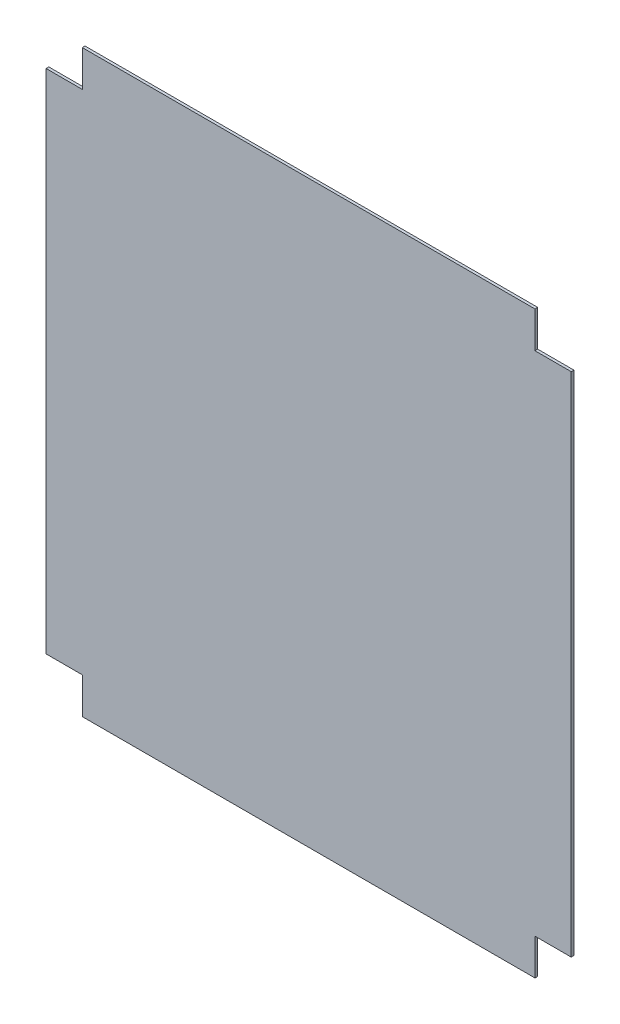
ISO-10303-21;
HEADER;
FILE_DESCRIPTION(('STEP AP214'),'2;1');
FILE_NAME('part.step','',(''),(''),'','','');
FILE_SCHEMA(('AUTOMOTIVE_DESIGN { 1 0 10303 214 1 1 1 1 }'));
ENDSEC;
DATA;
#1=APPLICATION_CONTEXT('core data for automotive mechanical design processes');
#2=APPLICATION_PROTOCOL_DEFINITION('international standard','automotive_design',2000,#1);
#3=PRODUCT_CONTEXT('',#1,'mechanical');
#4=PRODUCT('Part','Part','',(#3));
#5=PRODUCT_RELATED_PRODUCT_CATEGORY('part','',(#4));
#6=PRODUCT_DEFINITION_FORMATION('','',#4);
#7=PRODUCT_DEFINITION_CONTEXT('part definition',#1,'design');
#8=PRODUCT_DEFINITION('design','',#6,#7);
#9=PRODUCT_DEFINITION_SHAPE('','',#8);
#10=(LENGTH_UNIT() NAMED_UNIT(*) SI_UNIT(.MILLI.,.METRE.));
#11=(NAMED_UNIT(*) PLANE_ANGLE_UNIT() SI_UNIT($,.RADIAN.));
#12=(NAMED_UNIT(*) SI_UNIT($,.STERADIAN.) SOLID_ANGLE_UNIT());
#13=UNCERTAINTY_MEASURE_WITH_UNIT(LENGTH_MEASURE(1.E-05),#10,'distance_accuracy_value','');
#14=(GEOMETRIC_REPRESENTATION_CONTEXT(3) GLOBAL_UNCERTAINTY_ASSIGNED_CONTEXT((#13)) GLOBAL_UNIT_ASSIGNED_CONTEXT((#10,
#11,#12)) REPRESENTATION_CONTEXT('',''));
#15=CARTESIAN_POINT('',(0.,0.,0.));
#16=DIRECTION('',(0.,0.,1.));
#17=DIRECTION('',(1.,0.,0.));
#18=AXIS2_PLACEMENT_3D('',#15,#16,#17);
#19=CARTESIAN_POINT('',(-240.,390.,3.));
#20=DIRECTION('',(1.,0.,0.));
#21=DIRECTION('',(0.,0.,-1.));
#22=AXIS2_PLACEMENT_3D('',#19,#20,#21);
#23=PLANE('',#22);
#24=DIRECTION('',(0.,-1.,0.));
#25=VECTOR('',#24,1.);
#26=CARTESIAN_POINT('',(-240.,390.,0.));
#27=LINE('',#26,#25);
#28=CARTESIAN_POINT('',(-240.,390.,0.));
#29=VERTEX_POINT('',#28);
#30=CARTESIAN_POINT('',(-240.,350.,0.));
#31=VERTEX_POINT('',#30);
#32=EDGE_CURVE('E153',#29,#31,#27,.T.);
#33=ORIENTED_EDGE('',*,*,#32,.T.);
#34=DIRECTION('',(0.,0.,-1.));
#35=VECTOR('',#34,1.);
#36=CARTESIAN_POINT('',(-240.,350.,3.));
#37=LINE('',#36,#35);
#38=CARTESIAN_POINT('',(-240.,350.,3.));
#39=VERTEX_POINT('',#38);
#40=EDGE_CURVE('E11',#39,#31,#37,.T.);
#41=ORIENTED_EDGE('',*,*,#40,.F.);
#42=DIRECTION('',(0.,-1.,0.));
#43=VECTOR('',#42,1.);
#44=CARTESIAN_POINT('',(-240.,390.,3.));
#45=LINE('',#44,#43);
#46=CARTESIAN_POINT('',(-240.,390.,3.));
#47=VERTEX_POINT('',#46);
#48=EDGE_CURVE('E175',#47,#39,#45,.T.);
#49=ORIENTED_EDGE('',*,*,#48,.F.);
#50=DIRECTION('',(0.,0.,-1.));
#51=VECTOR('',#50,1.);
#52=CARTESIAN_POINT('',(-240.,390.,3.));
#53=LINE('',#52,#51);
#54=EDGE_CURVE('E149',#47,#29,#53,.T.);
#55=ORIENTED_EDGE('',*,*,#54,.T.);
#56=EDGE_LOOP('',(#33,#41,#49,#55));
#57=FACE_BOUND('',#56,.T.);
#58=ADVANCED_FACE('F33',(#57),#23,.F.);
#59=CARTESIAN_POINT('',(-280.,350.,3.));
#60=DIRECTION('',(0.,-1.,0.));
#61=DIRECTION('',(0.,0.,-1.));
#62=AXIS2_PLACEMENT_3D('',#59,#60,#61);
#63=PLANE('',#62);
#64=DIRECTION('',(-1.,0.,0.));
#65=VECTOR('',#64,1.);
#66=CARTESIAN_POINT('',(-280.,350.,0.));
#67=LINE('',#66,#65);
#68=CARTESIAN_POINT('',(-280.,350.,0.));
#69=VERTEX_POINT('',#68);
#70=EDGE_CURVE('E156',#31,#69,#67,.T.);
#71=ORIENTED_EDGE('',*,*,#70,.T.);
#72=DIRECTION('',(0.,0.,-1.));
#73=VECTOR('',#72,1.);
#74=CARTESIAN_POINT('',(-280.,350.,3.));
#75=LINE('',#74,#73);
#76=CARTESIAN_POINT('',(-280.,350.,3.));
#77=VERTEX_POINT('',#76);
#78=EDGE_CURVE('E41',#77,#69,#75,.T.);
#79=ORIENTED_EDGE('',*,*,#78,.F.);
#80=DIRECTION('',(-1.,0.,0.));
#81=VECTOR('',#80,1.);
#82=CARTESIAN_POINT('',(-280.,350.,3.));
#83=LINE('',#82,#81);
#84=EDGE_CURVE('E104',#39,#77,#83,.T.);
#85=ORIENTED_EDGE('',*,*,#84,.F.);
#86=ORIENTED_EDGE('',*,*,#40,.T.);
#87=EDGE_LOOP('',(#71,#79,#85,#86));
#88=FACE_BOUND('',#87,.T.);
#89=ADVANCED_FACE('F253',(#88),#63,.F.);
#90=CARTESIAN_POINT('',(-280.,-210.,3.));
#91=DIRECTION('',(1.,0.,0.));
#92=DIRECTION('',(0.,0.,-1.));
#93=AXIS2_PLACEMENT_3D('',#90,#91,#92);
#94=PLANE('',#93);
#95=DIRECTION('',(0.,-1.,0.));
#96=VECTOR('',#95,1.);
#97=CARTESIAN_POINT('',(-280.,-210.,0.));
#98=LINE('',#97,#96);
#99=CARTESIAN_POINT('',(-280.,-210.,0.));
#100=VERTEX_POINT('',#99);
#101=EDGE_CURVE('E158',#69,#100,#98,.T.);
#102=ORIENTED_EDGE('',*,*,#101,.T.);
#103=DIRECTION('',(0.,0.,-1.));
#104=VECTOR('',#103,1.);
#105=CARTESIAN_POINT('',(-280.,-210.,3.));
#106=LINE('',#105,#104);
#107=CARTESIAN_POINT('',(-280.,-210.,3.));
#108=VERTEX_POINT('',#107);
#109=EDGE_CURVE('E194',#108,#100,#106,.T.);
#110=ORIENTED_EDGE('',*,*,#109,.F.);
#111=DIRECTION('',(0.,-1.,0.));
#112=VECTOR('',#111,1.);
#113=CARTESIAN_POINT('',(-280.,-210.,3.));
#114=LINE('',#113,#112);
#115=EDGE_CURVE('E202',#77,#108,#114,.T.);
#116=ORIENTED_EDGE('',*,*,#115,.F.);
#117=ORIENTED_EDGE('',*,*,#78,.T.);
#118=EDGE_LOOP('',(#102,#110,#116,#117));
#119=FACE_BOUND('',#118,.T.);
#120=ADVANCED_FACE('F200',(#119),#94,.F.);
#121=CARTESIAN_POINT('',(-280.,-210.,3.));
#122=DIRECTION('',(0.,1.,0.));
#123=DIRECTION('',(0.,0.,1.));
#124=AXIS2_PLACEMENT_3D('',#121,#122,#123);
#125=PLANE('',#124);
#126=DIRECTION('',(1.,0.,0.));
#127=VECTOR('',#126,1.);
#128=CARTESIAN_POINT('',(-280.,-210.,0.));
#129=LINE('',#128,#127);
#130=CARTESIAN_POINT('',(-240.,-210.,0.));
#131=VERTEX_POINT('',#130);
#132=EDGE_CURVE('E160',#100,#131,#129,.T.);
#133=ORIENTED_EDGE('',*,*,#132,.T.);
#134=DIRECTION('',(0.,0.,-1.));
#135=VECTOR('',#134,1.);
#136=CARTESIAN_POINT('',(-240.,-210.,3.));
#137=LINE('',#136,#135);
#138=CARTESIAN_POINT('',(-240.,-210.,3.));
#139=VERTEX_POINT('',#138);
#140=EDGE_CURVE('E191',#139,#131,#137,.T.);
#141=ORIENTED_EDGE('',*,*,#140,.F.);
#142=DIRECTION('',(1.,0.,0.));
#143=VECTOR('',#142,1.);
#144=CARTESIAN_POINT('',(-280.,-210.,3.));
#145=LINE('',#144,#143);
#146=EDGE_CURVE('E220',#108,#139,#145,.T.);
#147=ORIENTED_EDGE('',*,*,#146,.F.);
#148=ORIENTED_EDGE('',*,*,#109,.T.);
#149=EDGE_LOOP('',(#133,#141,#147,#148));
#150=FACE_BOUND('',#149,.T.);
#151=ADVANCED_FACE('F211',(#150),#125,.F.);
#152=CARTESIAN_POINT('',(-240.,-250.,3.));
#153=DIRECTION('',(1.,0.,0.));
#154=DIRECTION('',(0.,0.,-1.));
#155=AXIS2_PLACEMENT_3D('',#152,#153,#154);
#156=PLANE('',#155);
#157=DIRECTION('',(0.,-1.,0.));
#158=VECTOR('',#157,1.);
#159=CARTESIAN_POINT('',(-240.,-250.,0.));
#160=LINE('',#159,#158);
#161=CARTESIAN_POINT('',(-240.,-250.,0.));
#162=VERTEX_POINT('',#161);
#163=EDGE_CURVE('E162',#131,#162,#160,.T.);
#164=ORIENTED_EDGE('',*,*,#163,.T.);
#165=DIRECTION('',(0.,0.,-1.));
#166=VECTOR('',#165,1.);
#167=CARTESIAN_POINT('',(-240.,-250.,3.));
#168=LINE('',#167,#166);
#169=CARTESIAN_POINT('',(-240.,-250.,3.));
#170=VERTEX_POINT('',#169);
#171=EDGE_CURVE('E188',#170,#162,#168,.T.);
#172=ORIENTED_EDGE('',*,*,#171,.F.);
#173=DIRECTION('',(0.,-1.,0.));
#174=VECTOR('',#173,1.);
#175=CARTESIAN_POINT('',(-240.,-250.,3.));
#176=LINE('',#175,#174);
#177=EDGE_CURVE('E217',#139,#170,#176,.T.);
#178=ORIENTED_EDGE('',*,*,#177,.F.);
#179=ORIENTED_EDGE('',*,*,#140,.T.);
#180=EDGE_LOOP('',(#164,#172,#178,#179));
#181=FACE_BOUND('',#180,.T.);
#182=ADVANCED_FACE('F215',(#181),#156,.F.);
#183=CARTESIAN_POINT('',(-240.,-250.,3.));
#184=DIRECTION('',(0.,1.,0.));
#185=DIRECTION('',(-1.,0.,0.));
#186=AXIS2_PLACEMENT_3D('',#183,#184,#185);
#187=PLANE('',#186);
#188=DIRECTION('',(1.,0.,0.));
#189=VECTOR('',#188,1.);
#190=CARTESIAN_POINT('',(-240.,-250.,0.));
#191=LINE('',#190,#189);
#192=CARTESIAN_POINT('',(260.,-250.,0.));
#193=VERTEX_POINT('',#192);
#194=EDGE_CURVE('E164',#162,#193,#191,.T.);
#195=ORIENTED_EDGE('',*,*,#194,.T.);
#196=DIRECTION('',(0.,0.,-1.));
#197=VECTOR('',#196,1.);
#198=CARTESIAN_POINT('',(260.,-250.,3.));
#199=LINE('',#198,#197);
#200=CARTESIAN_POINT('',(260.,-250.,3.));
#201=VERTEX_POINT('',#200);
#202=EDGE_CURVE('E185',#201,#193,#199,.T.);
#203=ORIENTED_EDGE('',*,*,#202,.F.);
#204=DIRECTION('',(1.,0.,0.));
#205=VECTOR('',#204,1.);
#206=CARTESIAN_POINT('',(-240.,-250.,3.));
#207=LINE('',#206,#205);
#208=EDGE_CURVE('E219',#170,#201,#207,.T.);
#209=ORIENTED_EDGE('',*,*,#208,.F.);
#210=ORIENTED_EDGE('',*,*,#171,.T.);
#211=EDGE_LOOP('',(#195,#203,#209,#210));
#212=FACE_BOUND('',#211,.T.);
#213=ADVANCED_FACE('F266',(#212),#187,.F.);
#214=CARTESIAN_POINT('',(260.,-250.,3.));
#215=DIRECTION('',(-1.,0.,0.));
#216=DIRECTION('',(0.,0.,1.));
#217=AXIS2_PLACEMENT_3D('',#214,#215,#216);
#218=PLANE('',#217);
#219=DIRECTION('',(0.,1.,0.));
#220=VECTOR('',#219,1.);
#221=CARTESIAN_POINT('',(260.,-250.,0.));
#222=LINE('',#221,#220);
#223=CARTESIAN_POINT('',(260.,-210.,0.));
#224=VERTEX_POINT('',#223);
#225=EDGE_CURVE('E166',#193,#224,#222,.T.);
#226=ORIENTED_EDGE('',*,*,#225,.T.);
#227=DIRECTION('',(0.,0.,-1.));
#228=VECTOR('',#227,1.);
#229=CARTESIAN_POINT('',(260.,-210.,3.));
#230=LINE('',#229,#228);
#231=CARTESIAN_POINT('',(260.,-210.,3.));
#232=VERTEX_POINT('',#231);
#233=EDGE_CURVE('E182',#232,#224,#230,.T.);
#234=ORIENTED_EDGE('',*,*,#233,.F.);
#235=DIRECTION('',(0.,1.,0.));
#236=VECTOR('',#235,1.);
#237=CARTESIAN_POINT('',(260.,-250.,3.));
#238=LINE('',#237,#236);
#239=EDGE_CURVE('E222',#201,#232,#238,.T.);
#240=ORIENTED_EDGE('',*,*,#239,.F.);
#241=ORIENTED_EDGE('',*,*,#202,.T.);
#242=EDGE_LOOP('',(#226,#234,#240,#241));
#243=FACE_BOUND('',#242,.T.);
#244=ADVANCED_FACE('F269',(#243),#218,.F.);
#245=CARTESIAN_POINT('',(300.,-210.,3.));
#246=DIRECTION('',(0.,1.,0.));
#247=DIRECTION('',(0.,0.,1.));
#248=AXIS2_PLACEMENT_3D('',#245,#246,#247);
#249=PLANE('',#248);
#250=DIRECTION('',(1.,0.,0.));
#251=VECTOR('',#250,1.);
#252=CARTESIAN_POINT('',(300.,-210.,0.));
#253=LINE('',#252,#251);
#254=CARTESIAN_POINT('',(300.,-210.,0.));
#255=VERTEX_POINT('',#254);
#256=EDGE_CURVE('E168',#224,#255,#253,.T.);
#257=ORIENTED_EDGE('',*,*,#256,.T.);
#258=DIRECTION('',(0.,0.,-1.));
#259=VECTOR('',#258,1.);
#260=CARTESIAN_POINT('',(300.,-210.,3.));
#261=LINE('',#260,#259);
#262=CARTESIAN_POINT('',(300.,-210.,3.));
#263=VERTEX_POINT('',#262);
#264=EDGE_CURVE('E179',#263,#255,#261,.T.);
#265=ORIENTED_EDGE('',*,*,#264,.F.);
#266=DIRECTION('',(1.,0.,0.));
#267=VECTOR('',#266,1.);
#268=CARTESIAN_POINT('',(300.,-210.,3.));
#269=LINE('',#268,#267);
#270=EDGE_CURVE('E228',#232,#263,#269,.T.);
#271=ORIENTED_EDGE('',*,*,#270,.F.);
#272=ORIENTED_EDGE('',*,*,#233,.T.);
#273=EDGE_LOOP('',(#257,#265,#271,#272));
#274=FACE_BOUND('',#273,.T.);
#275=ADVANCED_FACE('F234',(#274),#249,.F.);
#276=CARTESIAN_POINT('',(300.,-210.,3.));
#277=DIRECTION('',(-1.,0.,0.));
#278=DIRECTION('',(0.,0.,1.));
#279=AXIS2_PLACEMENT_3D('',#276,#277,#278);
#280=PLANE('',#279);
#281=DIRECTION('',(0.,1.,0.));
#282=VECTOR('',#281,1.);
#283=CARTESIAN_POINT('',(300.,-210.,0.));
#284=LINE('',#283,#282);
#285=CARTESIAN_POINT('',(300.,350.,0.));
#286=VERTEX_POINT('',#285);
#287=EDGE_CURVE('E170',#255,#286,#284,.T.);
#288=ORIENTED_EDGE('',*,*,#287,.T.);
#289=DIRECTION('',(0.,0.,-1.));
#290=VECTOR('',#289,1.);
#291=CARTESIAN_POINT('',(300.,350.,3.));
#292=LINE('',#291,#290);
#293=CARTESIAN_POINT('',(300.,350.,3.));
#294=VERTEX_POINT('',#293);
#295=EDGE_CURVE('E144',#294,#286,#292,.T.);
#296=ORIENTED_EDGE('',*,*,#295,.F.);
#297=DIRECTION('',(0.,1.,0.));
#298=VECTOR('',#297,1.);
#299=CARTESIAN_POINT('',(300.,-210.,3.));
#300=LINE('',#299,#298);
#301=EDGE_CURVE('E135',#263,#294,#300,.T.);
#302=ORIENTED_EDGE('',*,*,#301,.F.);
#303=ORIENTED_EDGE('',*,*,#264,.T.);
#304=EDGE_LOOP('',(#288,#296,#302,#303));
#305=FACE_BOUND('',#304,.T.);
#306=ADVANCED_FACE('F238',(#305),#280,.F.);
#307=CARTESIAN_POINT('',(300.,350.,3.));
#308=DIRECTION('',(0.,-1.,0.));
#309=DIRECTION('',(0.,0.,-1.));
#310=AXIS2_PLACEMENT_3D('',#307,#308,#309);
#311=PLANE('',#310);
#312=DIRECTION('',(-1.,0.,0.));
#313=VECTOR('',#312,1.);
#314=CARTESIAN_POINT('',(300.,350.,0.));
#315=LINE('',#314,#313);
#316=CARTESIAN_POINT('',(260.,350.,0.));
#317=VERTEX_POINT('',#316);
#318=EDGE_CURVE('E143',#286,#317,#315,.T.);
#319=ORIENTED_EDGE('',*,*,#318,.T.);
#320=DIRECTION('',(0.,0.,-1.));
#321=VECTOR('',#320,1.);
#322=CARTESIAN_POINT('',(260.,350.,3.));
#323=LINE('',#322,#321);
#324=CARTESIAN_POINT('',(260.,350.,3.));
#325=VERTEX_POINT('',#324);
#326=EDGE_CURVE('E140',#325,#317,#323,.T.);
#327=ORIENTED_EDGE('',*,*,#326,.F.);
#328=DIRECTION('',(-1.,0.,0.));
#329=VECTOR('',#328,1.);
#330=CARTESIAN_POINT('',(300.,350.,3.));
#331=LINE('',#330,#329);
#332=EDGE_CURVE('E129',#294,#325,#331,.T.);
#333=ORIENTED_EDGE('',*,*,#332,.F.);
#334=ORIENTED_EDGE('',*,*,#295,.T.);
#335=EDGE_LOOP('',(#319,#327,#333,#334));
#336=FACE_BOUND('',#335,.T.);
#337=ADVANCED_FACE('F141',(#336),#311,.F.);
#338=CARTESIAN_POINT('',(260.,390.,3.));
#339=DIRECTION('',(-1.,0.,0.));
#340=DIRECTION('',(0.,0.,1.));
#341=AXIS2_PLACEMENT_3D('',#338,#339,#340);
#342=PLANE('',#341);
#343=DIRECTION('',(0.,1.,0.));
#344=VECTOR('',#343,1.);
#345=CARTESIAN_POINT('',(260.,390.,0.));
#346=LINE('',#345,#344);
#347=CARTESIAN_POINT('',(260.,390.,0.));
#348=VERTEX_POINT('',#347);
#349=EDGE_CURVE('E90',#317,#348,#346,.T.);
#350=ORIENTED_EDGE('',*,*,#349,.T.);
#351=DIRECTION('',(0.,0.,-1.));
#352=VECTOR('',#351,1.);
#353=CARTESIAN_POINT('',(260.,390.,3.));
#354=LINE('',#353,#352);
#355=CARTESIAN_POINT('',(260.,390.,3.));
#356=VERTEX_POINT('',#355);
#357=EDGE_CURVE('E145',#356,#348,#354,.T.);
#358=ORIENTED_EDGE('',*,*,#357,.F.);
#359=DIRECTION('',(0.,1.,0.));
#360=VECTOR('',#359,1.);
#361=CARTESIAN_POINT('',(260.,390.,3.));
#362=LINE('',#361,#360);
#363=EDGE_CURVE('E133',#325,#356,#362,.T.);
#364=ORIENTED_EDGE('',*,*,#363,.F.);
#365=ORIENTED_EDGE('',*,*,#326,.T.);
#366=EDGE_LOOP('',(#350,#358,#364,#365));
#367=FACE_BOUND('',#366,.T.);
#368=ADVANCED_FACE('F147',(#367),#342,.F.);
#369=CARTESIAN_POINT('',(-240.,390.,3.));
#370=DIRECTION('',(0.,-1.,0.));
#371=DIRECTION('',(1.,0.,0.));
#372=AXIS2_PLACEMENT_3D('',#369,#370,#371);
#373=PLANE('',#372);
#374=DIRECTION('',(-1.,0.,0.));
#375=VECTOR('',#374,1.);
#376=CARTESIAN_POINT('',(-240.,390.,0.));
#377=LINE('',#376,#375);
#378=EDGE_CURVE('E96',#348,#29,#377,.T.);
#379=ORIENTED_EDGE('',*,*,#378,.T.);
#380=ORIENTED_EDGE('',*,*,#54,.F.);
#381=DIRECTION('',(-1.,0.,0.));
#382=VECTOR('',#381,1.);
#383=CARTESIAN_POINT('',(-240.,390.,3.));
#384=LINE('',#383,#382);
#385=EDGE_CURVE('E49',#356,#47,#384,.T.);
#386=ORIENTED_EDGE('',*,*,#385,.F.);
#387=ORIENTED_EDGE('',*,*,#357,.T.);
#388=EDGE_LOOP('',(#379,#380,#386,#387));
#389=FACE_BOUND('',#388,.T.);
#390=ADVANCED_FACE('F242',(#389),#373,.F.);
#391=CARTESIAN_POINT('',(0.,0.,3.));
#392=DIRECTION('',(0.,0.,1.));
#393=DIRECTION('',(1.,0.,0.));
#394=AXIS2_PLACEMENT_3D('',#391,#392,#393);
#395=PLANE('',#394);
#396=ORIENTED_EDGE('',*,*,#48,.T.);
#397=ORIENTED_EDGE('',*,*,#84,.T.);
#398=ORIENTED_EDGE('',*,*,#115,.T.);
#399=ORIENTED_EDGE('',*,*,#146,.T.);
#400=ORIENTED_EDGE('',*,*,#177,.T.);
#401=ORIENTED_EDGE('',*,*,#208,.T.);
#402=ORIENTED_EDGE('',*,*,#239,.T.);
#403=ORIENTED_EDGE('',*,*,#270,.T.);
#404=ORIENTED_EDGE('',*,*,#301,.T.);
#405=ORIENTED_EDGE('',*,*,#332,.T.);
#406=ORIENTED_EDGE('',*,*,#363,.T.);
#407=ORIENTED_EDGE('',*,*,#385,.T.);
#408=EDGE_LOOP('',(#396,#397,#398,#399,#400,#401,#402,#403,#404,#405,#406,#407));
#409=FACE_BOUND('',#408,.T.);
#410=ADVANCED_FACE('F131',(#409),#395,.T.);
#411=CARTESIAN_POINT('',(0.,0.,0.));
#412=DIRECTION('',(0.,0.,1.));
#413=DIRECTION('',(1.,0.,0.));
#414=AXIS2_PLACEMENT_3D('',#411,#412,#413);
#415=PLANE('',#414);
#416=ORIENTED_EDGE('',*,*,#32,.F.);
#417=ORIENTED_EDGE('',*,*,#378,.F.);
#418=ORIENTED_EDGE('',*,*,#349,.F.);
#419=ORIENTED_EDGE('',*,*,#318,.F.);
#420=ORIENTED_EDGE('',*,*,#287,.F.);
#421=ORIENTED_EDGE('',*,*,#256,.F.);
#422=ORIENTED_EDGE('',*,*,#225,.F.);
#423=ORIENTED_EDGE('',*,*,#194,.F.);
#424=ORIENTED_EDGE('',*,*,#163,.F.);
#425=ORIENTED_EDGE('',*,*,#132,.F.);
#426=ORIENTED_EDGE('',*,*,#101,.F.);
#427=ORIENTED_EDGE('',*,*,#70,.F.);
#428=EDGE_LOOP('',(#416,#417,#418,#419,#420,#421,#422,#423,#424,#425,#426,#427));
#429=FACE_BOUND('',#428,.T.);
#430=ADVANCED_FACE('F206',(#429),#415,.F.);
#431=CLOSED_SHELL('',(#58,#89,#120,#151,#182,#213,#244,#275,#306,#337,#368,#390,#410,#430));
#432=MANIFOLD_SOLID_BREP('B2',#431);
#433=ADVANCED_BREP_SHAPE_REPRESENTATION('',(#18,#432),#14);
#434=SHAPE_DEFINITION_REPRESENTATION(#9,#433);
ENDSEC;
END-ISO-10303-21;
